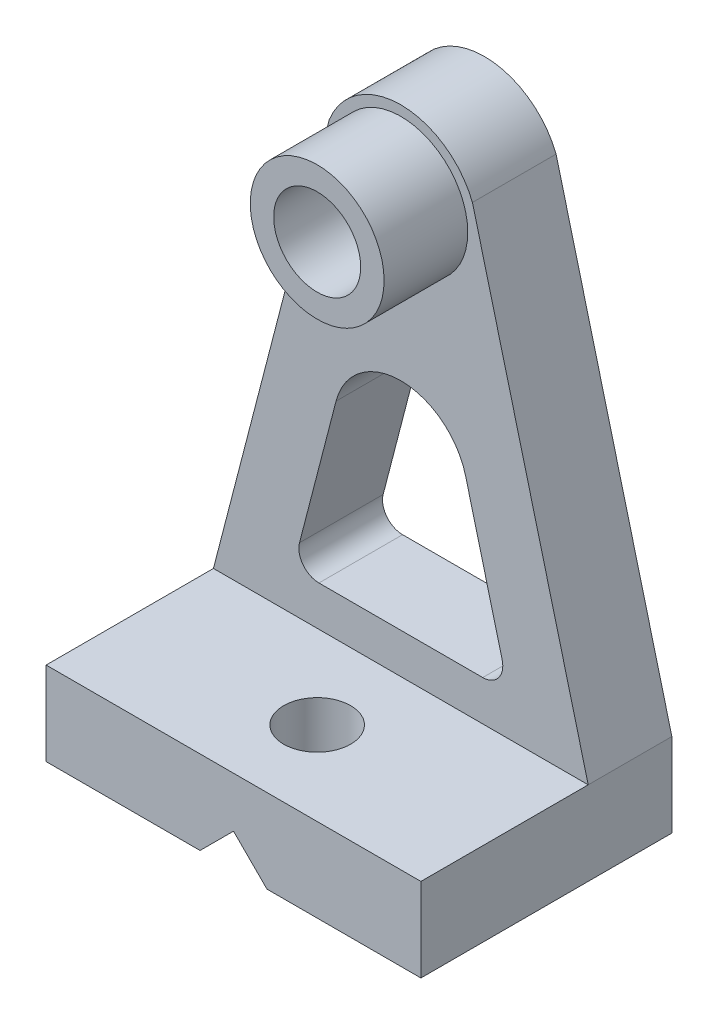
ISO-10303-21;
HEADER;
FILE_DESCRIPTION(('STEP AP214'),'2;1');
FILE_NAME('part.step','',(''),(''),'','','');
FILE_SCHEMA(('AUTOMOTIVE_DESIGN { 1 0 10303 214 1 1 1 1 }'));
ENDSEC;
DATA;
#1=APPLICATION_CONTEXT('core data for automotive mechanical design processes');
#2=APPLICATION_PROTOCOL_DEFINITION('international standard','automotive_design',2000,#1);
#3=PRODUCT_CONTEXT('',#1,'mechanical');
#4=PRODUCT('Part','Part','',(#3));
#5=PRODUCT_RELATED_PRODUCT_CATEGORY('part','',(#4));
#6=PRODUCT_DEFINITION_FORMATION('','',#4);
#7=PRODUCT_DEFINITION_CONTEXT('part definition',#1,'design');
#8=PRODUCT_DEFINITION('design','',#6,#7);
#9=PRODUCT_DEFINITION_SHAPE('','',#8);
#10=(LENGTH_UNIT() NAMED_UNIT(*) SI_UNIT(.MILLI.,.METRE.));
#11=(NAMED_UNIT(*) PLANE_ANGLE_UNIT() SI_UNIT($,.RADIAN.));
#12=(NAMED_UNIT(*) SI_UNIT($,.STERADIAN.) SOLID_ANGLE_UNIT());
#13=UNCERTAINTY_MEASURE_WITH_UNIT(LENGTH_MEASURE(1.E-05),#10,'distance_accuracy_value','');
#14=(GEOMETRIC_REPRESENTATION_CONTEXT(3) GLOBAL_UNCERTAINTY_ASSIGNED_CONTEXT((#13)) GLOBAL_UNIT_ASSIGNED_CONTEXT((#10,
#11,#12)) REPRESENTATION_CONTEXT('',''));
#15=CARTESIAN_POINT('',(0.,0.,0.));
#16=DIRECTION('',(0.,0.,1.));
#17=DIRECTION('',(1.,0.,0.));
#18=AXIS2_PLACEMENT_3D('',#15,#16,#17);
#19=CARTESIAN_POINT('',(0.,0.,25.));
#20=DIRECTION('',(0.,0.,1.));
#21=DIRECTION('',(1.,0.,0.));
#22=AXIS2_PLACEMENT_3D('',#19,#20,#21);
#23=PLANE('',#22);
#24=DIRECTION('',(0.251013022083158,-0.967983709958324,0.));
#25=VECTOR('',#24,1.);
#26=CARTESIAN_POINT('',(42.1184528881327,10.9219608100352,25.));
#27=LINE('',#26,#25);
#28=CARTESIAN_POINT('',(20.8157141147677,93.0718984466708,25.));
#29=VERTEX_POINT('',#28);
#30=CARTESIAN_POINT('',(55.4158968469563,-40.3570884974574,25.));
#31=VERTEX_POINT('',#30);
#32=EDGE_CURVE('E286',#29,#31,#27,.T.);
#33=ORIENTED_EDGE('',*,*,#32,.F.);
#34=CARTESIAN_POINT('',(-0.584103153043673,84.6429115025426,25.));
#35=DIRECTION('',(0.,0.,1.));
#36=DIRECTION('',(1.,0.,0.));
#37=AXIS2_PLACEMENT_3D('',#34,#35,#36);
#38=CIRCLE('',#37,23.);
#39=CARTESIAN_POINT('',(-21.983920420855,93.0718984466708,25.));
#40=VERTEX_POINT('',#39);
#41=EDGE_CURVE('E289',#29,#40,#38,.T.);
#42=ORIENTED_EDGE('',*,*,#41,.T.);
#43=DIRECTION('',(-0.251013022083158,-0.967983709958324,0.));
#44=VECTOR('',#43,1.);
#45=CARTESIAN_POINT('',(-43.2130533918673,11.2058075086827,25.));
#46=LINE('',#45,#44);
#47=CARTESIAN_POINT('',(-56.5841031530437,-40.3570884974574,25.));
#48=VERTEX_POINT('',#47);
#49=EDGE_CURVE('E292',#40,#48,#46,.T.);
#50=ORIENTED_EDGE('',*,*,#49,.T.);
#51=DIRECTION('',(1.,0.,0.));
#52=VECTOR('',#51,1.);
#53=CARTESIAN_POINT('',(0.,-40.3570884974574,25.));
#54=LINE('',#53,#52);
#55=EDGE_CURVE('E295',#48,#31,#54,.T.);
#56=ORIENTED_EDGE('',*,*,#55,.T.);
#57=EDGE_LOOP('',(#33,#42,#50,#56));
#58=FACE_BOUND('',#57,.T.);
#59=CARTESIAN_POINT('',(23.8882646321427,-22.3570884974574,25.));
#60=DIRECTION('',(0.,0.,1.));
#61=DIRECTION('',(1.,0.,0.));
#62=AXIS2_PLACEMENT_3D('',#59,#60,#61);
#63=CIRCLE('',#62,6.);
#64=CARTESIAN_POINT('',(23.8882646321427,-28.3570884974574,25.));
#65=VERTEX_POINT('',#64);
#66=CARTESIAN_POINT('',(29.6961668918926,-20.8510103649585,25.));
#67=VERTEX_POINT('',#66);
#68=EDGE_CURVE('E58',#65,#67,#63,.T.);
#69=ORIENTED_EDGE('',*,*,#68,.F.);
#70=DIRECTION('',(1.,0.,0.));
#71=VECTOR('',#70,1.);
#72=CARTESIAN_POINT('',(-25.0564709382301,-28.3570884974574,25.));
#73=LINE('',#72,#71);
#74=CARTESIAN_POINT('',(-25.0564709382301,-28.3570884974574,25.));
#75=VERTEX_POINT('',#74);
#76=EDGE_CURVE('E186',#75,#65,#73,.T.);
#77=ORIENTED_EDGE('',*,*,#76,.F.);
#78=CARTESIAN_POINT('',(-25.0564709382301,-22.3570884974574,25.));
#79=DIRECTION('',(0.,0.,1.));
#80=DIRECTION('',(-1.,0.,0.));
#81=AXIS2_PLACEMENT_3D('',#78,#79,#80);
#82=CIRCLE('',#81,6.);
#83=CARTESIAN_POINT('',(-30.86437319798,-20.8510103649585,25.));
#84=VERTEX_POINT('',#83);
#85=EDGE_CURVE('E189',#84,#75,#82,.T.);
#86=ORIENTED_EDGE('',*,*,#85,.F.);
#87=DIRECTION('',(-0.251013022083158,-0.967983709958324,0.));
#88=VECTOR('',#87,1.);
#89=CARTESIAN_POINT('',(-19.9437773522101,21.262178799553,25.));
#90=LINE('',#89,#88);
#91=CARTESIAN_POINT('',(-19.9437773522101,21.262178799553,25.));
#92=VERTEX_POINT('',#91);
#93=EDGE_CURVE('E208',#92,#84,#90,.T.);
#94=ORIENTED_EDGE('',*,*,#93,.F.);
#95=CARTESIAN_POINT('',(-0.584103153043673,16.2419183578899,25.));
#96=DIRECTION('',(0.,0.,1.));
#97=DIRECTION('',(1.,0.,0.));
#98=AXIS2_PLACEMENT_3D('',#95,#96,#97);
#99=CIRCLE('',#98,20.);
#100=CARTESIAN_POINT('',(18.7755710461228,21.262178799553,25.));
#101=VERTEX_POINT('',#100);
#102=EDGE_CURVE('E205',#101,#92,#99,.T.);
#103=ORIENTED_EDGE('',*,*,#102,.F.);
#104=DIRECTION('',(-0.251013022083158,0.967983709958324,0.));
#105=VECTOR('',#104,1.);
#106=CARTESIAN_POINT('',(18.7755710461228,21.262178799553,25.));
#107=LINE('',#106,#105);
#108=EDGE_CURVE('E203',#67,#101,#107,.T.);
#109=ORIENTED_EDGE('',*,*,#108,.F.);
#110=EDGE_LOOP('',(#69,#77,#86,#94,#103,#109));
#111=FACE_BOUND('',#110,.T.);
#112=CARTESIAN_POINT('',(-0.584103153043673,84.6429115025426,25.));
#113=DIRECTION('',(0.,0.,1.));
#114=DIRECTION('',(1.,0.,0.));
#115=AXIS2_PLACEMENT_3D('',#112,#113,#114);
#116=CIRCLE('',#115,20.);
#117=CARTESIAN_POINT('',(19.4158968469563,84.6429115025426,25.));
#118=VERTEX_POINT('',#117);
#119=EDGE_CURVE('E192',#118,#118,#116,.F.);
#120=ORIENTED_EDGE('',*,*,#119,.T.);
#121=EDGE_LOOP('',(#120));
#122=FACE_BOUND('',#121,.T.);
#123=ADVANCED_FACE('F43',(#58,#111,#122),#23,.T.);
#124=CARTESIAN_POINT('',(-10.5841031530437,-65.3570884974574,0.));
#125=DIRECTION('',(-0.707106781186547,0.707106781186548,0.));
#126=DIRECTION('',(-0.707106781186548,-0.707106781186547,0.));
#127=AXIS2_PLACEMENT_3D('',#124,#125,#126);
#128=PLANE('',#127);
#129=DIRECTION('',(0.,0.,1.));
#130=VECTOR('',#129,1.);
#131=CARTESIAN_POINT('',(-0.584103153043678,-55.3570884974574,0.));
#132=LINE('',#131,#130);
#133=CARTESIAN_POINT('',(-0.584103153043678,-55.3570884974574,0.));
#134=VERTEX_POINT('',#133);
#135=CARTESIAN_POINT('',(-0.584103153043678,-55.3570884974574,40.));
#136=VERTEX_POINT('',#135);
#137=EDGE_CURVE('E247',#134,#136,#132,.T.);
#138=ORIENTED_EDGE('',*,*,#137,.T.);
#139=CARTESIAN_POINT('',(-0.584103153043677,-55.3570884974574,50.));
#140=DIRECTION('',(-0.707106781186547,0.707106781186548,0.));
#141=DIRECTION('',(0.707106781186548,0.707106781186547,0.));
#142=AXIS2_PLACEMENT_3D('',#139,#140,#141);
#143=ELLIPSE('',#142,14.142135623731,10.);
#144=CARTESIAN_POINT('',(-10.5841031530437,-65.3570884974574,50.));
#145=VERTEX_POINT('',#144);
#146=EDGE_CURVE('E228',#136,#145,#143,.T.);
#147=ORIENTED_EDGE('',*,*,#146,.T.);
#148=DIRECTION('',(0.,0.,1.));
#149=VECTOR('',#148,1.);
#150=CARTESIAN_POINT('',(-10.5841031530437,-65.3570884974574,0.));
#151=LINE('',#150,#149);
#152=CARTESIAN_POINT('',(-10.5841031530437,-65.3570884974574,0.));
#153=VERTEX_POINT('',#152);
#154=EDGE_CURVE('E242',#153,#145,#151,.T.);
#155=ORIENTED_EDGE('',*,*,#154,.F.);
#156=DIRECTION('',(-0.707106781186548,-0.707106781186547,0.));
#157=VECTOR('',#156,1.);
#158=CARTESIAN_POINT('',(-10.5841031530437,-65.3570884974574,0.));
#159=LINE('',#158,#157);
#160=EDGE_CURVE('E232',#134,#153,#159,.T.);
#161=ORIENTED_EDGE('',*,*,#160,.F.);
#162=EDGE_LOOP('',(#138,#147,#155,#161));
#163=FACE_BOUND('',#162,.T.);
#164=ADVANCED_FACE('F326',(#163),#128,.F.);
#165=CARTESIAN_POINT('',(-0.584103153043678,-55.3570884974574,0.));
#166=DIRECTION('',(0.707106781186547,0.707106781186548,0.));
#167=DIRECTION('',(-0.707106781186548,0.707106781186547,0.));
#168=AXIS2_PLACEMENT_3D('',#165,#166,#167);
#169=PLANE('',#168);
#170=CARTESIAN_POINT('',(-0.584103153043678,-55.3570884974574,60.));
#171=VERTEX_POINT('',#170);
#172=CARTESIAN_POINT('',(-0.584103153043678,-55.3570884974574,75.));
#173=VERTEX_POINT('',#172);
#174=EDGE_CURVE('E250',#171,#173,#132,.T.);
#175=ORIENTED_EDGE('',*,*,#174,.F.);
#176=CARTESIAN_POINT('',(-0.584103153043677,-55.3570884974574,50.));
#177=DIRECTION('',(0.707106781186547,0.707106781186548,0.));
#178=DIRECTION('',(-0.707106781186548,0.707106781186547,0.));
#179=AXIS2_PLACEMENT_3D('',#176,#177,#178);
#180=ELLIPSE('',#179,14.142135623731,10.);
#181=CARTESIAN_POINT('',(9.41589684695634,-65.3570884974574,50.));
#182=VERTEX_POINT('',#181);
#183=EDGE_CURVE('E12',#171,#182,#180,.T.);
#184=ORIENTED_EDGE('',*,*,#183,.T.);
#185=DIRECTION('',(0.,0.,1.));
#186=VECTOR('',#185,1.);
#187=CARTESIAN_POINT('',(9.41589684695632,-65.3570884974574,0.));
#188=LINE('',#187,#186);
#189=CARTESIAN_POINT('',(9.41589684695632,-65.3570884974574,75.));
#190=VERTEX_POINT('',#189);
#191=EDGE_CURVE('E236',#182,#190,#188,.T.);
#192=ORIENTED_EDGE('',*,*,#191,.T.);
#193=DIRECTION('',(-0.707106781186548,0.707106781186547,0.));
#194=VECTOR('',#193,1.);
#195=CARTESIAN_POINT('',(-0.584103153043678,-55.3570884974574,75.));
#196=LINE('',#195,#194);
#197=EDGE_CURVE('E237',#190,#173,#196,.T.);
#198=ORIENTED_EDGE('',*,*,#197,.T.);
#199=EDGE_LOOP('',(#175,#184,#192,#198));
#200=FACE_BOUND('',#199,.T.);
#201=ADVANCED_FACE('F339',(#200),#169,.F.);
#202=CARTESIAN_POINT('',(-56.5841031530437,-65.3570884974574,0.));
#203=DIRECTION('',(0.,-1.,0.));
#204=DIRECTION('',(0.,0.,-1.));
#205=AXIS2_PLACEMENT_3D('',#202,#203,#204);
#206=PLANE('',#205);
#207=ORIENTED_EDGE('',*,*,#154,.T.);
#208=CARTESIAN_POINT('',(-10.5841031530437,-65.3570884974574,75.));
#209=VERTEX_POINT('',#208);
#210=EDGE_CURVE('E246',#145,#209,#151,.T.);
#211=ORIENTED_EDGE('',*,*,#210,.T.);
#212=DIRECTION('',(1.,0.,0.));
#213=VECTOR('',#212,1.);
#214=CARTESIAN_POINT('',(-56.5841031530437,-65.3570884974574,75.));
#215=LINE('',#214,#213);
#216=CARTESIAN_POINT('',(-56.5841031530437,-65.3570884974574,75.));
#217=VERTEX_POINT('',#216);
#218=EDGE_CURVE('E280',#217,#209,#215,.T.);
#219=ORIENTED_EDGE('',*,*,#218,.F.);
#220=DIRECTION('',(0.,0.,-1.));
#221=VECTOR('',#220,1.);
#222=CARTESIAN_POINT('',(-56.5841031530437,-65.3570884974574,0.));
#223=LINE('',#222,#221);
#224=CARTESIAN_POINT('',(-56.5841031530437,-65.3570884974574,0.));
#225=VERTEX_POINT('',#224);
#226=EDGE_CURVE('E271',#217,#225,#223,.T.);
#227=ORIENTED_EDGE('',*,*,#226,.T.);
#228=DIRECTION('',(1.,0.,0.));
#229=VECTOR('',#228,1.);
#230=CARTESIAN_POINT('',(-56.5841031530437,-65.3570884974574,0.));
#231=LINE('',#230,#229);
#232=EDGE_CURVE('E275',#225,#153,#231,.T.);
#233=ORIENTED_EDGE('',*,*,#232,.T.);
#234=EDGE_LOOP('',(#207,#211,#219,#227,#233));
#235=FACE_BOUND('',#234,.T.);
#236=ADVANCED_FACE('F385',(#235),#206,.T.);
#237=CARTESIAN_POINT('',(42.1184528881327,10.9219608100352,25.));
#238=DIRECTION('',(0.967983709958324,0.251013022083158,0.));
#239=DIRECTION('',(-0.251013022083158,0.967983709958324,0.));
#240=AXIS2_PLACEMENT_3D('',#237,#238,#239);
#241=PLANE('',#240);
#242=DIRECTION('',(0.251013022083158,-0.967983709958324,0.));
#243=VECTOR('',#242,1.);
#244=CARTESIAN_POINT('',(42.1184528881327,10.9219608100352,0.));
#245=LINE('',#244,#243);
#246=CARTESIAN_POINT('',(20.8157141147677,93.0718984466708,0.));
#247=VERTEX_POINT('',#246);
#248=CARTESIAN_POINT('',(55.4158968469563,-40.3570884974574,0.));
#249=VERTEX_POINT('',#248);
#250=EDGE_CURVE('E278',#247,#249,#245,.T.);
#251=ORIENTED_EDGE('',*,*,#250,.F.);
#252=DIRECTION('',(0.,0.,-1.));
#253=VECTOR('',#252,1.);
#254=CARTESIAN_POINT('',(20.8157141147677,93.0718984466708,25.));
#255=LINE('',#254,#253);
#256=EDGE_CURVE('E314',#29,#247,#255,.T.);
#257=ORIENTED_EDGE('',*,*,#256,.F.);
#258=ORIENTED_EDGE('',*,*,#32,.T.);
#259=DIRECTION('',(0.,0.,-1.));
#260=VECTOR('',#259,1.);
#261=CARTESIAN_POINT('',(55.4158968469563,-40.3570884974574,25.));
#262=LINE('',#261,#260);
#263=EDGE_CURVE('E298',#31,#249,#262,.T.);
#264=ORIENTED_EDGE('',*,*,#263,.T.);
#265=EDGE_LOOP('',(#251,#257,#258,#264));
#266=FACE_BOUND('',#265,.T.);
#267=ADVANCED_FACE('F45',(#266),#241,.T.);
#268=CARTESIAN_POINT('',(-0.584103153043673,84.6429115025426,25.));
#269=DIRECTION('',(0.,0.,-1.));
#270=DIRECTION('',(-1.,0.,0.));
#271=AXIS2_PLACEMENT_3D('',#268,#269,#270);
#272=CYLINDRICAL_SURFACE('',#271,23.);
#273=CARTESIAN_POINT('',(-0.584103153043673,84.6429115025426,0.));
#274=DIRECTION('',(0.,0.,1.));
#275=DIRECTION('',(1.,0.,0.));
#276=AXIS2_PLACEMENT_3D('',#273,#274,#275);
#277=CIRCLE('',#276,23.);
#278=CARTESIAN_POINT('',(-21.983920420855,93.0718984466708,0.));
#279=VERTEX_POINT('',#278);
#280=EDGE_CURVE('E301',#247,#279,#277,.T.);
#281=ORIENTED_EDGE('',*,*,#280,.T.);
#282=DIRECTION('',(0.,0.,-1.));
#283=VECTOR('',#282,1.);
#284=CARTESIAN_POINT('',(-21.983920420855,93.0718984466708,25.));
#285=LINE('',#284,#283);
#286=EDGE_CURVE('E312',#40,#279,#285,.T.);
#287=ORIENTED_EDGE('',*,*,#286,.F.);
#288=ORIENTED_EDGE('',*,*,#41,.F.);
#289=ORIENTED_EDGE('',*,*,#256,.T.);
#290=EDGE_LOOP('',(#281,#287,#288,#289));
#291=FACE_BOUND('',#290,.T.);
#292=ADVANCED_FACE('F379',(#291),#272,.T.);
#293=CARTESIAN_POINT('',(-43.2130533918673,11.2058075086827,25.));
#294=DIRECTION('',(0.967983709958324,-0.251013022083158,0.));
#295=DIRECTION('',(0.251013022083158,0.967983709958324,0.));
#296=AXIS2_PLACEMENT_3D('',#293,#294,#295);
#297=PLANE('',#296);
#298=DIRECTION('',(-0.251013022083158,-0.967983709958324,0.));
#299=VECTOR('',#298,1.);
#300=CARTESIAN_POINT('',(-43.2130533918673,11.2058075086827,0.));
#301=LINE('',#300,#299);
#302=CARTESIAN_POINT('',(-56.5841031530437,-40.3570884974574,0.));
#303=VERTEX_POINT('',#302);
#304=EDGE_CURVE('E303',#279,#303,#301,.T.);
#305=ORIENTED_EDGE('',*,*,#304,.T.);
#306=DIRECTION('',(0.,0.,-1.));
#307=VECTOR('',#306,1.);
#308=CARTESIAN_POINT('',(-56.5841031530437,-40.3570884974574,25.));
#309=LINE('',#308,#307);
#310=EDGE_CURVE('E310',#48,#303,#309,.T.);
#311=ORIENTED_EDGE('',*,*,#310,.F.);
#312=ORIENTED_EDGE('',*,*,#49,.F.);
#313=ORIENTED_EDGE('',*,*,#286,.T.);
#314=EDGE_LOOP('',(#305,#311,#312,#313));
#315=FACE_BOUND('',#314,.T.);
#316=ADVANCED_FACE('F376',(#315),#297,.F.);
#317=CARTESIAN_POINT('',(-0.584103153043673,84.6429115025426,25.));
#318=DIRECTION('',(0.,0.,-1.));
#319=DIRECTION('',(-1.,0.,0.));
#320=AXIS2_PLACEMENT_3D('',#317,#318,#319);
#321=CYLINDRICAL_SURFACE('',#320,13.);
#322=CARTESIAN_POINT('',(-0.584103153043673,84.6429115025426,0.));
#323=DIRECTION('',(0.,0.,1.));
#324=DIRECTION('',(1.,0.,0.));
#325=AXIS2_PLACEMENT_3D('',#322,#323,#324);
#326=CIRCLE('',#325,13.);
#327=CARTESIAN_POINT('',(12.4158968469563,84.6429115025426,0.));
#328=VERTEX_POINT('',#327);
#329=EDGE_CURVE('E290',#328,#328,#326,.T.);
#330=ORIENTED_EDGE('',*,*,#329,.F.);
#331=EDGE_LOOP('',(#330));
#332=FACE_BOUND('',#331,.T.);
#333=CARTESIAN_POINT('',(-0.584103153043673,84.6429115025426,50.));
#334=DIRECTION('',(0.,0.,1.));
#335=DIRECTION('',(1.,0.,0.));
#336=AXIS2_PLACEMENT_3D('',#333,#334,#335);
#337=CIRCLE('',#336,13.);
#338=CARTESIAN_POINT('',(12.4158968469563,84.6429115025426,50.));
#339=VERTEX_POINT('',#338);
#340=EDGE_CURVE('E550',#339,#339,#337,.T.);
#341=ORIENTED_EDGE('',*,*,#340,.T.);
#342=EDGE_LOOP('',(#341));
#343=FACE_BOUND('',#342,.T.);
#344=ADVANCED_FACE('F372',(#332,#343),#321,.F.);
#345=CARTESIAN_POINT('',(0.,0.,0.));
#346=DIRECTION('',(0.,0.,1.));
#347=DIRECTION('',(1.,0.,0.));
#348=AXIS2_PLACEMENT_3D('',#345,#346,#347);
#349=PLANE('',#348);
#350=ORIENTED_EDGE('',*,*,#329,.T.);
#351=EDGE_LOOP('',(#350));
#352=FACE_BOUND('',#351,.T.);
#353=DIRECTION('',(-0.707106781186548,0.707106781186547,0.));
#354=VECTOR('',#353,1.);
#355=CARTESIAN_POINT('',(-0.584103153043678,-55.3570884974574,0.));
#356=LINE('',#355,#354);
#357=CARTESIAN_POINT('',(9.41589684695632,-65.3570884974574,0.));
#358=VERTEX_POINT('',#357);
#359=EDGE_CURVE('E229',#358,#134,#356,.T.);
#360=ORIENTED_EDGE('',*,*,#359,.T.);
#361=ORIENTED_EDGE('',*,*,#160,.T.);
#362=ORIENTED_EDGE('',*,*,#232,.F.);
#363=DIRECTION('',(0.,1.,0.));
#364=VECTOR('',#363,1.);
#365=CARTESIAN_POINT('',(-56.5841031530437,-40.3570884974574,0.));
#366=LINE('',#365,#364);
#367=EDGE_CURVE('E263',#225,#303,#366,.T.);
#368=ORIENTED_EDGE('',*,*,#367,.T.);
#369=ORIENTED_EDGE('',*,*,#304,.F.);
#370=ORIENTED_EDGE('',*,*,#280,.F.);
#371=ORIENTED_EDGE('',*,*,#250,.T.);
#372=DIRECTION('',(0.,1.,0.));
#373=VECTOR('',#372,1.);
#374=CARTESIAN_POINT('',(55.4158968469563,-40.3570884974574,0.));
#375=LINE('',#374,#373);
#376=CARTESIAN_POINT('',(55.4158968469563,-65.3570884974574,0.));
#377=VERTEX_POINT('',#376);
#378=EDGE_CURVE('E245',#377,#249,#375,.T.);
#379=ORIENTED_EDGE('',*,*,#378,.F.);
#380=EDGE_CURVE('E279',#358,#377,#231,.T.);
#381=ORIENTED_EDGE('',*,*,#380,.F.);
#382=EDGE_LOOP('',(#360,#361,#362,#368,#369,#370,#371,#379,#381));
#383=FACE_BOUND('',#382,.T.);
#384=DIRECTION('',(1.,0.,0.));
#385=VECTOR('',#384,1.);
#386=CARTESIAN_POINT('',(-25.0564709382301,-28.3570884974574,0.));
#387=LINE('',#386,#385);
#388=CARTESIAN_POINT('',(-25.0564709382301,-28.3570884974574,0.));
#389=VERTEX_POINT('',#388);
#390=CARTESIAN_POINT('',(23.8882646321427,-28.3570884974574,0.));
#391=VERTEX_POINT('',#390);
#392=EDGE_CURVE('E176',#389,#391,#387,.T.);
#393=ORIENTED_EDGE('',*,*,#392,.T.);
#394=CARTESIAN_POINT('',(23.8882646321427,-22.3570884974574,0.));
#395=DIRECTION('',(0.,0.,1.));
#396=DIRECTION('',(1.,0.,0.));
#397=AXIS2_PLACEMENT_3D('',#394,#395,#396);
#398=CIRCLE('',#397,6.);
#399=CARTESIAN_POINT('',(29.6961668918926,-20.8510103649585,0.));
#400=VERTEX_POINT('',#399);
#401=EDGE_CURVE('E170',#391,#400,#398,.T.);
#402=ORIENTED_EDGE('',*,*,#401,.T.);
#403=DIRECTION('',(-0.251013022083158,0.967983709958324,0.));
#404=VECTOR('',#403,1.);
#405=CARTESIAN_POINT('',(18.7755710461228,21.262178799553,0.));
#406=LINE('',#405,#404);
#407=CARTESIAN_POINT('',(18.7755710461228,21.262178799553,0.));
#408=VERTEX_POINT('',#407);
#409=EDGE_CURVE('E179',#400,#408,#406,.T.);
#410=ORIENTED_EDGE('',*,*,#409,.T.);
#411=CARTESIAN_POINT('',(-0.584103153043673,16.2419183578899,0.));
#412=DIRECTION('',(0.,0.,1.));
#413=DIRECTION('',(1.,0.,0.));
#414=AXIS2_PLACEMENT_3D('',#411,#412,#413);
#415=CIRCLE('',#414,20.);
#416=CARTESIAN_POINT('',(-19.9437773522101,21.262178799553,0.));
#417=VERTEX_POINT('',#416);
#418=EDGE_CURVE('E66',#408,#417,#415,.T.);
#419=ORIENTED_EDGE('',*,*,#418,.T.);
#420=DIRECTION('',(-0.251013022083158,-0.967983709958324,0.));
#421=VECTOR('',#420,1.);
#422=CARTESIAN_POINT('',(-19.9437773522101,21.262178799553,0.));
#423=LINE('',#422,#421);
#424=CARTESIAN_POINT('',(-30.86437319798,-20.8510103649585,0.));
#425=VERTEX_POINT('',#424);
#426=EDGE_CURVE('E196',#417,#425,#423,.T.);
#427=ORIENTED_EDGE('',*,*,#426,.T.);
#428=CARTESIAN_POINT('',(-25.0564709382301,-22.3570884974574,0.));
#429=DIRECTION('',(0.,0.,1.));
#430=DIRECTION('',(-1.,0.,0.));
#431=AXIS2_PLACEMENT_3D('',#428,#429,#430);
#432=CIRCLE('',#431,6.);
#433=EDGE_CURVE('E199',#425,#389,#432,.T.);
#434=ORIENTED_EDGE('',*,*,#433,.T.);
#435=EDGE_LOOP('',(#393,#402,#410,#419,#427,#434));
#436=FACE_BOUND('',#435,.T.);
#437=ADVANCED_FACE('F183',(#352,#383,#436),#349,.F.);
#438=CARTESIAN_POINT('',(-56.5841031530437,-40.3570884974574,0.));
#439=DIRECTION('',(0.,1.,0.));
#440=DIRECTION('',(0.,0.,1.));
#441=AXIS2_PLACEMENT_3D('',#438,#439,#440);
#442=PLANE('',#441);
#443=CARTESIAN_POINT('',(-0.584103153043677,-40.3570884974574,50.));
#444=DIRECTION('',(0.,1.,0.));
#445=DIRECTION('',(0.,0.,1.));
#446=AXIS2_PLACEMENT_3D('',#443,#444,#445);
#447=CIRCLE('',#446,10.);
#448=CARTESIAN_POINT('',(-0.584103153043677,-40.3570884974574,60.));
#449=VERTEX_POINT('',#448);
#450=EDGE_CURVE('E215',#449,#449,#447,.T.);
#451=ORIENTED_EDGE('',*,*,#450,.F.);
#452=EDGE_LOOP('',(#451));
#453=FACE_BOUND('',#452,.T.);
#454=ORIENTED_EDGE('',*,*,#55,.F.);
#455=DIRECTION('',(0.,0.,1.));
#456=VECTOR('',#455,1.);
#457=CARTESIAN_POINT('',(-56.5841031530437,-40.3570884974574,0.));
#458=LINE('',#457,#456);
#459=CARTESIAN_POINT('',(-56.5841031530437,-40.3570884974574,75.));
#460=VERTEX_POINT('',#459);
#461=EDGE_CURVE('E266',#48,#460,#458,.T.);
#462=ORIENTED_EDGE('',*,*,#461,.T.);
#463=DIRECTION('',(1.,0.,0.));
#464=VECTOR('',#463,1.);
#465=CARTESIAN_POINT('',(-56.5841031530437,-40.3570884974574,75.));
#466=LINE('',#465,#464);
#467=CARTESIAN_POINT('',(55.4158968469563,-40.3570884974574,75.));
#468=VERTEX_POINT('',#467);
#469=EDGE_CURVE('E274',#460,#468,#466,.T.);
#470=ORIENTED_EDGE('',*,*,#469,.T.);
#471=DIRECTION('',(0.,0.,1.));
#472=VECTOR('',#471,1.);
#473=CARTESIAN_POINT('',(55.4158968469563,-40.3570884974574,0.));
#474=LINE('',#473,#472);
#475=EDGE_CURVE('E255',#31,#468,#474,.T.);
#476=ORIENTED_EDGE('',*,*,#475,.F.);
#477=EDGE_LOOP('',(#454,#462,#470,#476));
#478=FACE_BOUND('',#477,.T.);
#479=ADVANCED_FACE('F368',(#453,#478),#442,.T.);
#480=EDGE_CURVE('E251',#358,#182,#188,.T.);
#481=ORIENTED_EDGE('',*,*,#480,.F.);
#482=ORIENTED_EDGE('',*,*,#380,.T.);
#483=DIRECTION('',(0.,0.,-1.));
#484=VECTOR('',#483,1.);
#485=CARTESIAN_POINT('',(55.4158968469563,-65.3570884974574,0.));
#486=LINE('',#485,#484);
#487=CARTESIAN_POINT('',(55.4158968469563,-65.3570884974574,75.));
#488=VERTEX_POINT('',#487);
#489=EDGE_CURVE('E260',#488,#377,#486,.T.);
#490=ORIENTED_EDGE('',*,*,#489,.F.);
#491=EDGE_CURVE('E283',#190,#488,#215,.T.);
#492=ORIENTED_EDGE('',*,*,#491,.F.);
#493=ORIENTED_EDGE('',*,*,#191,.F.);
#494=EDGE_LOOP('',(#481,#482,#490,#492,#493));
#495=FACE_BOUND('',#494,.T.);
#496=ADVANCED_FACE('F333',(#495),#206,.T.);
#497=CARTESIAN_POINT('',(-56.5841031530437,-40.3570884974574,75.));
#498=DIRECTION('',(0.,0.,1.));
#499=DIRECTION('',(0.,-1.,0.));
#500=AXIS2_PLACEMENT_3D('',#497,#498,#499);
#501=PLANE('',#500);
#502=DIRECTION('',(-0.707106781186548,-0.707106781186547,0.));
#503=VECTOR('',#502,1.);
#504=CARTESIAN_POINT('',(-10.5841031530437,-65.3570884974574,75.));
#505=LINE('',#504,#503);
#506=EDGE_CURVE('E233',#173,#209,#505,.T.);
#507=ORIENTED_EDGE('',*,*,#506,.F.);
#508=ORIENTED_EDGE('',*,*,#197,.F.);
#509=ORIENTED_EDGE('',*,*,#491,.T.);
#510=DIRECTION('',(0.,-1.,0.));
#511=VECTOR('',#510,1.);
#512=CARTESIAN_POINT('',(55.4158968469563,-40.3570884974574,75.));
#513=LINE('',#512,#511);
#514=EDGE_CURVE('E257',#468,#488,#513,.T.);
#515=ORIENTED_EDGE('',*,*,#514,.F.);
#516=ORIENTED_EDGE('',*,*,#469,.F.);
#517=DIRECTION('',(0.,-1.,0.));
#518=VECTOR('',#517,1.);
#519=CARTESIAN_POINT('',(-56.5841031530437,-40.3570884974574,75.));
#520=LINE('',#519,#518);
#521=EDGE_CURVE('E268',#460,#217,#520,.T.);
#522=ORIENTED_EDGE('',*,*,#521,.T.);
#523=ORIENTED_EDGE('',*,*,#218,.T.);
#524=EDGE_LOOP('',(#507,#508,#509,#515,#516,#522,#523));
#525=FACE_BOUND('',#524,.T.);
#526=ADVANCED_FACE('F342',(#525),#501,.T.);
#527=CARTESIAN_POINT('',(-56.5841031530437,0.,0.));
#528=DIRECTION('',(-1.,0.,0.));
#529=DIRECTION('',(0.,0.,1.));
#530=AXIS2_PLACEMENT_3D('',#527,#528,#529);
#531=PLANE('',#530);
#532=ORIENTED_EDGE('',*,*,#367,.F.);
#533=ORIENTED_EDGE('',*,*,#226,.F.);
#534=ORIENTED_EDGE('',*,*,#521,.F.);
#535=ORIENTED_EDGE('',*,*,#461,.F.);
#536=ORIENTED_EDGE('',*,*,#310,.T.);
#537=EDGE_LOOP('',(#532,#533,#534,#535,#536));
#538=FACE_BOUND('',#537,.T.);
#539=ADVANCED_FACE('F395',(#538),#531,.T.);
#540=CARTESIAN_POINT('',(55.4158968469563,0.,0.));
#541=DIRECTION('',(-1.,0.,0.));
#542=DIRECTION('',(0.,0.,1.));
#543=AXIS2_PLACEMENT_3D('',#540,#541,#542);
#544=PLANE('',#543);
#545=ORIENTED_EDGE('',*,*,#378,.T.);
#546=ORIENTED_EDGE('',*,*,#263,.F.);
#547=ORIENTED_EDGE('',*,*,#475,.T.);
#548=ORIENTED_EDGE('',*,*,#514,.T.);
#549=ORIENTED_EDGE('',*,*,#489,.T.);
#550=EDGE_LOOP('',(#545,#546,#547,#548,#549));
#551=FACE_BOUND('',#550,.T.);
#552=ADVANCED_FACE('F402',(#551),#544,.F.);
#553=ORIENTED_EDGE('',*,*,#210,.F.);
#554=EDGE_CURVE('E225',#145,#171,#143,.T.);
#555=ORIENTED_EDGE('',*,*,#554,.T.);
#556=ORIENTED_EDGE('',*,*,#174,.T.);
#557=ORIENTED_EDGE('',*,*,#506,.T.);
#558=EDGE_LOOP('',(#553,#555,#556,#557));
#559=FACE_BOUND('',#558,.T.);
#560=ADVANCED_FACE('F345',(#559),#128,.F.);
#561=ORIENTED_EDGE('',*,*,#480,.T.);
#562=EDGE_CURVE('E47',#182,#136,#180,.T.);
#563=ORIENTED_EDGE('',*,*,#562,.T.);
#564=ORIENTED_EDGE('',*,*,#137,.F.);
#565=ORIENTED_EDGE('',*,*,#359,.F.);
#566=EDGE_LOOP('',(#561,#563,#564,#565));
#567=FACE_BOUND('',#566,.T.);
#568=ADVANCED_FACE('F320',(#567),#169,.F.);
#569=CARTESIAN_POINT('',(-0.584103153043677,-65.3570884974574,50.));
#570=DIRECTION('',(0.,1.,0.));
#571=DIRECTION('',(0.,0.,1.));
#572=AXIS2_PLACEMENT_3D('',#569,#570,#571);
#573=CYLINDRICAL_SURFACE('',#572,10.);
#574=ORIENTED_EDGE('',*,*,#450,.T.);
#575=EDGE_LOOP('',(#574));
#576=FACE_BOUND('',#575,.T.);
#577=ORIENTED_EDGE('',*,*,#562,.F.);
#578=ORIENTED_EDGE('',*,*,#183,.F.);
#579=ORIENTED_EDGE('',*,*,#554,.F.);
#580=ORIENTED_EDGE('',*,*,#146,.F.);
#581=EDGE_LOOP('',(#577,#578,#579,#580));
#582=FACE_BOUND('',#581,.T.);
#583=ADVANCED_FACE('F346',(#576,#582),#573,.F.);
#584=CARTESIAN_POINT('',(23.8882646321427,-22.3570884974574,0.));
#585=DIRECTION('',(0.,0.,1.));
#586=DIRECTION('',(1.,0.,0.));
#587=AXIS2_PLACEMENT_3D('',#584,#585,#586);
#588=CYLINDRICAL_SURFACE('',#587,6.);
#589=ORIENTED_EDGE('',*,*,#68,.T.);
#590=DIRECTION('',(0.,0.,1.));
#591=VECTOR('',#590,1.);
#592=CARTESIAN_POINT('',(29.6961668918926,-20.8510103649585,0.));
#593=LINE('',#592,#591);
#594=EDGE_CURVE('E166',#400,#67,#593,.T.);
#595=ORIENTED_EDGE('',*,*,#594,.F.);
#596=ORIENTED_EDGE('',*,*,#401,.F.);
#597=DIRECTION('',(0.,0.,1.));
#598=VECTOR('',#597,1.);
#599=CARTESIAN_POINT('',(23.8882646321427,-28.3570884974574,0.));
#600=LINE('',#599,#598);
#601=EDGE_CURVE('E213',#391,#65,#600,.T.);
#602=ORIENTED_EDGE('',*,*,#601,.T.);
#603=EDGE_LOOP('',(#589,#595,#596,#602));
#604=FACE_BOUND('',#603,.T.);
#605=ADVANCED_FACE('F168',(#604),#588,.F.);
#606=CARTESIAN_POINT('',(-25.0564709382301,-28.3570884974574,0.));
#607=DIRECTION('',(0.,-1.,0.));
#608=DIRECTION('',(1.,0.,0.));
#609=AXIS2_PLACEMENT_3D('',#606,#607,#608);
#610=PLANE('',#609);
#611=ORIENTED_EDGE('',*,*,#76,.T.);
#612=ORIENTED_EDGE('',*,*,#601,.F.);
#613=ORIENTED_EDGE('',*,*,#392,.F.);
#614=DIRECTION('',(0.,0.,1.));
#615=VECTOR('',#614,1.);
#616=CARTESIAN_POINT('',(-25.0564709382301,-28.3570884974574,0.));
#617=LINE('',#616,#615);
#618=EDGE_CURVE('E216',#389,#75,#617,.T.);
#619=ORIENTED_EDGE('',*,*,#618,.T.);
#620=EDGE_LOOP('',(#611,#612,#613,#619));
#621=FACE_BOUND('',#620,.T.);
#622=ADVANCED_FACE('F354',(#621),#610,.F.);
#623=CARTESIAN_POINT('',(-25.0564709382301,-22.3570884974574,0.));
#624=DIRECTION('',(0.,0.,1.));
#625=DIRECTION('',(1.,0.,0.));
#626=AXIS2_PLACEMENT_3D('',#623,#624,#625);
#627=CYLINDRICAL_SURFACE('',#626,6.);
#628=ORIENTED_EDGE('',*,*,#85,.T.);
#629=ORIENTED_EDGE('',*,*,#618,.F.);
#630=ORIENTED_EDGE('',*,*,#433,.F.);
#631=DIRECTION('',(0.,0.,1.));
#632=VECTOR('',#631,1.);
#633=CARTESIAN_POINT('',(-30.86437319798,-20.8510103649585,0.));
#634=LINE('',#633,#632);
#635=EDGE_CURVE('E218',#425,#84,#634,.T.);
#636=ORIENTED_EDGE('',*,*,#635,.T.);
#637=EDGE_LOOP('',(#628,#629,#630,#636));
#638=FACE_BOUND('',#637,.T.);
#639=ADVANCED_FACE('F463',(#638),#627,.F.);
#640=CARTESIAN_POINT('',(-19.9437773522101,21.262178799553,0.));
#641=DIRECTION('',(-0.967983709958324,0.251013022083158,0.));
#642=DIRECTION('',(-0.251013022083158,-0.967983709958324,0.));
#643=AXIS2_PLACEMENT_3D('',#640,#641,#642);
#644=PLANE('',#643);
#645=ORIENTED_EDGE('',*,*,#93,.T.);
#646=ORIENTED_EDGE('',*,*,#635,.F.);
#647=ORIENTED_EDGE('',*,*,#426,.F.);
#648=DIRECTION('',(0.,0.,1.));
#649=VECTOR('',#648,1.);
#650=CARTESIAN_POINT('',(-19.9437773522101,21.262178799553,0.));
#651=LINE('',#650,#649);
#652=EDGE_CURVE('E220',#417,#92,#651,.T.);
#653=ORIENTED_EDGE('',*,*,#652,.T.);
#654=EDGE_LOOP('',(#645,#646,#647,#653));
#655=FACE_BOUND('',#654,.T.);
#656=ADVANCED_FACE('F473',(#655),#644,.F.);
#657=CARTESIAN_POINT('',(-0.584103153043673,16.2419183578899,0.));
#658=DIRECTION('',(0.,0.,1.));
#659=DIRECTION('',(1.,0.,0.));
#660=AXIS2_PLACEMENT_3D('',#657,#658,#659);
#661=CYLINDRICAL_SURFACE('',#660,20.);
#662=ORIENTED_EDGE('',*,*,#102,.T.);
#663=ORIENTED_EDGE('',*,*,#652,.F.);
#664=ORIENTED_EDGE('',*,*,#418,.F.);
#665=DIRECTION('',(0.,0.,1.));
#666=VECTOR('',#665,1.);
#667=CARTESIAN_POINT('',(18.7755710461228,21.262178799553,0.));
#668=LINE('',#667,#666);
#669=EDGE_CURVE('E175',#408,#101,#668,.T.);
#670=ORIENTED_EDGE('',*,*,#669,.T.);
#671=EDGE_LOOP('',(#662,#663,#664,#670));
#672=FACE_BOUND('',#671,.T.);
#673=ADVANCED_FACE('F483',(#672),#661,.F.);
#674=CARTESIAN_POINT('',(18.7755710461228,21.262178799553,0.));
#675=DIRECTION('',(0.967983709958324,0.251013022083158,0.));
#676=DIRECTION('',(-0.251013022083158,0.967983709958324,0.));
#677=AXIS2_PLACEMENT_3D('',#674,#675,#676);
#678=PLANE('',#677);
#679=ORIENTED_EDGE('',*,*,#108,.T.);
#680=ORIENTED_EDGE('',*,*,#669,.F.);
#681=ORIENTED_EDGE('',*,*,#409,.F.);
#682=ORIENTED_EDGE('',*,*,#594,.T.);
#683=EDGE_LOOP('',(#679,#680,#681,#682));
#684=FACE_BOUND('',#683,.T.);
#685=ADVANCED_FACE('F180',(#684),#678,.F.);
#686=CARTESIAN_POINT('',(-0.584103153043673,84.6429115025426,50.));
#687=DIRECTION('',(0.,0.,1.));
#688=DIRECTION('',(1.,0.,0.));
#689=AXIS2_PLACEMENT_3D('',#686,#687,#688);
#690=PLANE('',#689);
#691=CARTESIAN_POINT('',(-0.584103153043673,84.6429115025426,50.));
#692=DIRECTION('',(0.,0.,1.));
#693=DIRECTION('',(1.,0.,0.));
#694=AXIS2_PLACEMENT_3D('',#691,#692,#693);
#695=CIRCLE('',#694,20.);
#696=CARTESIAN_POINT('',(19.4158968469563,84.6429115025426,50.));
#697=VERTEX_POINT('',#696);
#698=EDGE_CURVE('E549',#697,#697,#695,.T.);
#699=ORIENTED_EDGE('',*,*,#698,.T.);
#700=EDGE_LOOP('',(#699));
#701=FACE_BOUND('',#700,.T.);
#702=ORIENTED_EDGE('',*,*,#340,.F.);
#703=EDGE_LOOP('',(#702));
#704=FACE_BOUND('',#703,.T.);
#705=ADVANCED_FACE('F500',(#701,#704),#690,.T.);
#706=CARTESIAN_POINT('',(-0.584103153043673,84.6429115025426,50.));
#707=DIRECTION('',(0.,0.,-1.));
#708=DIRECTION('',(-1.,0.,0.));
#709=AXIS2_PLACEMENT_3D('',#706,#707,#708);
#710=CYLINDRICAL_SURFACE('',#709,20.);
#711=ORIENTED_EDGE('',*,*,#119,.F.);
#712=EDGE_LOOP('',(#711));
#713=FACE_BOUND('',#712,.T.);
#714=ORIENTED_EDGE('',*,*,#698,.F.);
#715=EDGE_LOOP('',(#714));
#716=FACE_BOUND('',#715,.T.);
#717=ADVANCED_FACE('F530',(#713,#716),#710,.T.);
#718=CLOSED_SHELL('',(#123,#164,#201,#236,#267,#292,#316,#344,#437,#479,#496,#526,#539,#552,
#560,#568,#583,#605,#622,#639,#656,#673,#685,#705,#717));
#719=MANIFOLD_SOLID_BREP('B2',#718);
#720=ADVANCED_BREP_SHAPE_REPRESENTATION('',(#18,#719),#14);
#721=SHAPE_DEFINITION_REPRESENTATION(#9,#720);
ENDSEC;
END-ISO-10303-21;
